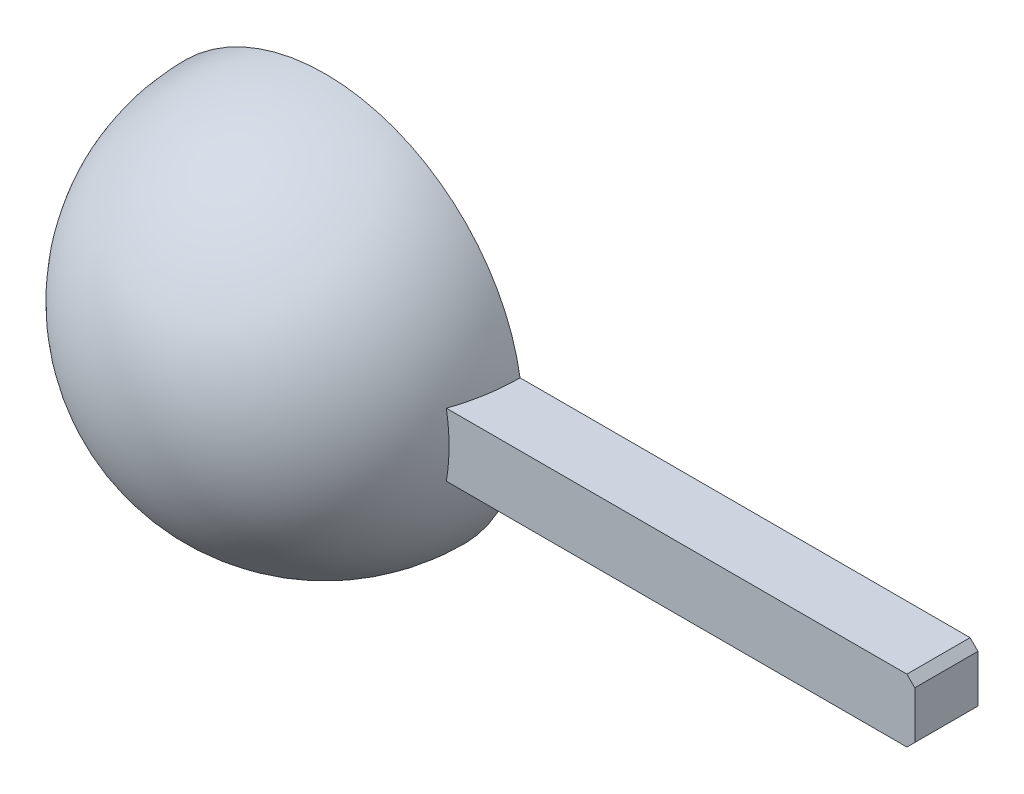
ISO-10303-21;
HEADER;
FILE_DESCRIPTION(('STEP AP214'),'2;1');
FILE_NAME('part.step','',(''),(''),'','','');
FILE_SCHEMA(('AUTOMOTIVE_DESIGN { 1 0 10303 214 1 1 1 1 }'));
ENDSEC;
DATA;
#1=APPLICATION_CONTEXT('core data for automotive mechanical design processes');
#2=APPLICATION_PROTOCOL_DEFINITION('international standard','automotive_design',2000,#1);
#3=PRODUCT_CONTEXT('',#1,'mechanical');
#4=PRODUCT('Part','Part','',(#3));
#5=PRODUCT_RELATED_PRODUCT_CATEGORY('part','',(#4));
#6=PRODUCT_DEFINITION_FORMATION('','',#4);
#7=PRODUCT_DEFINITION_CONTEXT('part definition',#1,'design');
#8=PRODUCT_DEFINITION('design','',#6,#7);
#9=PRODUCT_DEFINITION_SHAPE('','',#8);
#10=(LENGTH_UNIT() NAMED_UNIT(*) SI_UNIT(.MILLI.,.METRE.));
#11=(NAMED_UNIT(*) PLANE_ANGLE_UNIT() SI_UNIT($,.RADIAN.));
#12=(NAMED_UNIT(*) SI_UNIT($,.STERADIAN.) SOLID_ANGLE_UNIT());
#13=UNCERTAINTY_MEASURE_WITH_UNIT(LENGTH_MEASURE(1.E-05),#10,'distance_accuracy_value','');
#14=(GEOMETRIC_REPRESENTATION_CONTEXT(3) GLOBAL_UNCERTAINTY_ASSIGNED_CONTEXT((#13)) GLOBAL_UNIT_ASSIGNED_CONTEXT((#10,
#11,#12)) REPRESENTATION_CONTEXT('',''));
#15=CARTESIAN_POINT('',(0.,0.,0.));
#16=DIRECTION('',(0.,0.,1.));
#17=DIRECTION('',(1.,0.,0.));
#18=AXIS2_PLACEMENT_3D('',#15,#16,#17);
#19=CARTESIAN_POINT('',(0.,0.,0.));
#20=DIRECTION('',(-1.,0.,0.));
#21=DIRECTION('',(0.,-1.,0.));
#22=AXIS2_PLACEMENT_3D('',#19,#20,#21);
#23=SPHERICAL_SURFACE('',#22,25.);
#24=CARTESIAN_POINT('',(0.,0.,8.));
#25=DIRECTION('',(0.,0.,-1.));
#26=DIRECTION('',(-1.,0.,0.));
#27=AXIS2_PLACEMENT_3D('',#24,#25,#26);
#28=CIRCLE('',#27,23.685438564654);
#29=CARTESIAN_POINT('',(23.3452350598575,4.,8.));
#30=VERTEX_POINT('',#29);
#31=CARTESIAN_POINT('',(23.3452350598575,-4.,8.));
#32=VERTEX_POINT('',#31);
#33=EDGE_CURVE('E105',#30,#32,#28,.T.);
#34=ORIENTED_EDGE('',*,*,#33,.F.);
#35=CARTESIAN_POINT('',(0.,4.,0.));
#36=DIRECTION('',(0.,1.,0.));
#37=DIRECTION('',(0.,0.,1.));
#38=AXIS2_PLACEMENT_3D('',#35,#36,#37);
#39=CIRCLE('',#38,24.6779253585061);
#40=CARTESIAN_POINT('',(24.6779253585061,4.,0.));
#41=VERTEX_POINT('',#40);
#42=EDGE_CURVE('E100',#30,#41,#39,.T.);
#43=ORIENTED_EDGE('',*,*,#42,.T.);
#44=CARTESIAN_POINT('',(0.,0.,0.));
#45=DIRECTION('',(0.,0.,-1.));
#46=DIRECTION('',(-1.,0.,0.));
#47=AXIS2_PLACEMENT_3D('',#44,#45,#46);
#48=CIRCLE('',#47,25.);
#49=CARTESIAN_POINT('',(24.6779253585061,-4.,0.));
#50=VERTEX_POINT('',#49);
#51=EDGE_CURVE('E99',#50,#41,#48,.T.);
#52=ORIENTED_EDGE('',*,*,#51,.F.);
#53=CARTESIAN_POINT('',(0.,-4.,0.));
#54=DIRECTION('',(0.,-1.,0.));
#55=DIRECTION('',(1.,0.,0.));
#56=AXIS2_PLACEMENT_3D('',#53,#54,#55);
#57=CIRCLE('',#56,24.6779253585061);
#58=EDGE_CURVE('E118',#50,#32,#57,.T.);
#59=ORIENTED_EDGE('',*,*,#58,.T.);
#60=EDGE_LOOP('',(#34,#43,#52,#59));
#61=FACE_BOUND('',#60,.T.);
#62=ADVANCED_FACE('F33',(#61),#23,.T.);
#63=CARTESIAN_POINT('',(0.,0.,0.));
#64=DIRECTION('',(0.,0.,1.));
#65=DIRECTION('',(-1.,0.,0.));
#66=AXIS2_PLACEMENT_3D('',#63,#64,#65);
#67=PLANE('',#66);
#68=DIRECTION('',(0.,1.,0.));
#69=VECTOR('',#68,1.);
#70=CARTESIAN_POINT('',(22.6495033058122,-4.,0.));
#71=LINE('',#70,#69);
#72=CARTESIAN_POINT('',(22.6495033058122,-4.,0.));
#73=VERTEX_POINT('',#72);
#74=CARTESIAN_POINT('',(22.6495033058122,4.,0.));
#75=VERTEX_POINT('',#74);
#76=EDGE_CURVE('E96',#73,#75,#71,.T.);
#77=ORIENTED_EDGE('',*,*,#76,.T.);
#78=CARTESIAN_POINT('',(0.,0.,0.));
#79=DIRECTION('',(0.,0.,1.));
#80=DIRECTION('',(0.,-1.,0.));
#81=AXIS2_PLACEMENT_3D('',#78,#79,#80);
#82=CIRCLE('',#81,23.);
#83=EDGE_CURVE('E91',#73,#75,#82,.F.);
#84=ORIENTED_EDGE('',*,*,#83,.F.);
#85=EDGE_LOOP('',(#77,#84));
#86=FACE_BOUND('',#85,.T.);
#87=DIRECTION('',(1.,0.,0.));
#88=VECTOR('',#87,1.);
#89=CARTESIAN_POINT('',(22.6495033058122,4.,0.));
#90=LINE('',#89,#88);
#91=CARTESIAN_POINT('',(81.6495033058122,4.,0.));
#92=VERTEX_POINT('',#91);
#93=EDGE_CURVE('E108',#41,#92,#90,.T.);
#94=ORIENTED_EDGE('',*,*,#93,.T.);
#95=DIRECTION('',(-0.707106781186552,0.707106781186543,0.));
#96=VECTOR('',#95,1.);
#97=CARTESIAN_POINT('',(81.6495033058122,4.00000000000003,0.));
#98=LINE('',#97,#96);
#99=CARTESIAN_POINT('',(82.6495033058122,3.,0.));
#100=VERTEX_POINT('',#99);
#101=EDGE_CURVE('E133',#92,#100,#98,.F.);
#102=ORIENTED_EDGE('',*,*,#101,.T.);
#103=DIRECTION('',(0.,-1.,0.));
#104=VECTOR('',#103,1.);
#105=CARTESIAN_POINT('',(82.6495033058122,4.,0.));
#106=LINE('',#105,#104);
#107=CARTESIAN_POINT('',(82.6495033058122,-3.,0.));
#108=VERTEX_POINT('',#107);
#109=EDGE_CURVE('E114',#100,#108,#106,.T.);
#110=ORIENTED_EDGE('',*,*,#109,.T.);
#111=DIRECTION('',(0.707106781186552,0.707106781186543,0.));
#112=VECTOR('',#111,1.);
#113=CARTESIAN_POINT('',(82.6495033058123,-2.99999999999998,0.));
#114=LINE('',#113,#112);
#115=CARTESIAN_POINT('',(81.6495033058122,-3.99999999999999,0.));
#116=VERTEX_POINT('',#115);
#117=EDGE_CURVE('E131',#108,#116,#114,.F.);
#118=ORIENTED_EDGE('',*,*,#117,.T.);
#119=DIRECTION('',(-1.,0.,0.));
#120=VECTOR('',#119,1.);
#121=CARTESIAN_POINT('',(82.6495033058122,-3.99999999999999,0.));
#122=LINE('',#121,#120);
#123=EDGE_CURVE('E109',#116,#50,#122,.T.);
#124=ORIENTED_EDGE('',*,*,#123,.T.);
#125=ORIENTED_EDGE('',*,*,#51,.T.);
#126=EDGE_LOOP('',(#94,#102,#110,#118,#124,#125));
#127=FACE_BOUND('',#126,.T.);
#128=ADVANCED_FACE('F93',(#86,#127),#67,.F.);
#129=CARTESIAN_POINT('',(0.,0.,0.));
#130=DIRECTION('',(-1.,0.,0.));
#131=DIRECTION('',(0.,-1.,0.));
#132=AXIS2_PLACEMENT_3D('',#129,#130,#131);
#133=SPHERICAL_SURFACE('',#132,23.);
#134=CARTESIAN_POINT('',(22.6495033058122,0.,0.));
#135=DIRECTION('',(-1.,0.,0.));
#136=DIRECTION('',(0.,0.,1.));
#137=AXIS2_PLACEMENT_3D('',#134,#135,#136);
#138=CIRCLE('',#137,3.99999999999999);
#139=EDGE_CURVE('E102',#73,#75,#138,.T.);
#140=ORIENTED_EDGE('',*,*,#139,.F.);
#141=ORIENTED_EDGE('',*,*,#83,.T.);
#142=EDGE_LOOP('',(#140,#141));
#143=FACE_BOUND('',#142,.T.);
#144=ADVANCED_FACE('F103',(#143),#133,.F.);
#145=CARTESIAN_POINT('',(22.6495033058122,-4.,8.));
#146=DIRECTION('',(-1.,0.,0.));
#147=DIRECTION('',(0.,0.,1.));
#148=AXIS2_PLACEMENT_3D('',#145,#146,#147);
#149=PLANE('',#148);
#150=ORIENTED_EDGE('',*,*,#76,.F.);
#151=ORIENTED_EDGE('',*,*,#139,.T.);
#152=EDGE_LOOP('',(#150,#151));
#153=FACE_BOUND('',#152,.T.);
#154=ADVANCED_FACE('F107',(#153),#149,.T.);
#155=CARTESIAN_POINT('',(82.6495033058122,4.,8.));
#156=DIRECTION('',(1.,0.,0.));
#157=DIRECTION('',(0.,0.,-1.));
#158=AXIS2_PLACEMENT_3D('',#155,#156,#157);
#159=PLANE('',#158);
#160=ORIENTED_EDGE('',*,*,#109,.F.);
#161=DIRECTION('',(0.,0.,1.));
#162=VECTOR('',#161,1.);
#163=CARTESIAN_POINT('',(82.6495033058122,3.,8.));
#164=LINE('',#163,#162);
#165=CARTESIAN_POINT('',(82.6495033058122,3.,8.));
#166=VERTEX_POINT('',#165);
#167=EDGE_CURVE('E138',#100,#166,#164,.T.);
#168=ORIENTED_EDGE('',*,*,#167,.T.);
#169=DIRECTION('',(0.,-1.,0.));
#170=VECTOR('',#169,1.);
#171=CARTESIAN_POINT('',(82.6495033058122,4.,8.));
#172=LINE('',#171,#170);
#173=CARTESIAN_POINT('',(82.6495033058122,-3.,8.));
#174=VERTEX_POINT('',#173);
#175=EDGE_CURVE('E112',#166,#174,#172,.T.);
#176=ORIENTED_EDGE('',*,*,#175,.T.);
#177=DIRECTION('',(0.,0.,-1.));
#178=VECTOR('',#177,1.);
#179=CARTESIAN_POINT('',(82.6495033058122,-3.,8.));
#180=LINE('',#179,#178);
#181=EDGE_CURVE('E135',#174,#108,#180,.T.);
#182=ORIENTED_EDGE('',*,*,#181,.T.);
#183=EDGE_LOOP('',(#160,#168,#176,#182));
#184=FACE_BOUND('',#183,.T.);
#185=ADVANCED_FACE('F156',(#184),#159,.T.);
#186=CARTESIAN_POINT('',(22.6495033058122,4.,8.));
#187=DIRECTION('',(0.,1.,0.));
#188=DIRECTION('',(0.,0.,1.));
#189=AXIS2_PLACEMENT_3D('',#186,#187,#188);
#190=PLANE('',#189);
#191=DIRECTION('',(1.,0.,0.));
#192=VECTOR('',#191,1.);
#193=CARTESIAN_POINT('',(22.6495033058122,4.,8.));
#194=LINE('',#193,#192);
#195=CARTESIAN_POINT('',(81.6495033058122,4.,8.));
#196=VERTEX_POINT('',#195);
#197=EDGE_CURVE('E121',#30,#196,#194,.T.);
#198=ORIENTED_EDGE('',*,*,#197,.T.);
#199=DIRECTION('',(0.,0.,-1.));
#200=VECTOR('',#199,1.);
#201=CARTESIAN_POINT('',(81.6495033058122,4.,8.));
#202=LINE('',#201,#200);
#203=EDGE_CURVE('E128',#196,#92,#202,.T.);
#204=ORIENTED_EDGE('',*,*,#203,.T.);
#205=ORIENTED_EDGE('',*,*,#93,.F.);
#206=ORIENTED_EDGE('',*,*,#42,.F.);
#207=EDGE_LOOP('',(#198,#204,#205,#206));
#208=FACE_BOUND('',#207,.T.);
#209=ADVANCED_FACE('F149',(#208),#190,.T.);
#210=CARTESIAN_POINT('',(82.6495033058122,-3.99999999999999,8.));
#211=DIRECTION('',(0.,-1.,0.));
#212=DIRECTION('',(1.,0.,0.));
#213=AXIS2_PLACEMENT_3D('',#210,#211,#212);
#214=PLANE('',#213);
#215=ORIENTED_EDGE('',*,*,#123,.F.);
#216=DIRECTION('',(0.,0.,1.));
#217=VECTOR('',#216,1.);
#218=CARTESIAN_POINT('',(81.6495033058122,-3.99999999999999,8.));
#219=LINE('',#218,#217);
#220=CARTESIAN_POINT('',(81.6495033058122,-3.99999999999999,8.));
#221=VERTEX_POINT('',#220);
#222=EDGE_CURVE('E11',#116,#221,#219,.T.);
#223=ORIENTED_EDGE('',*,*,#222,.T.);
#224=DIRECTION('',(-1.,0.,0.));
#225=VECTOR('',#224,1.);
#226=CARTESIAN_POINT('',(82.6495033058122,-3.99999999999999,8.));
#227=LINE('',#226,#225);
#228=EDGE_CURVE('E150',#221,#32,#227,.T.);
#229=ORIENTED_EDGE('',*,*,#228,.T.);
#230=ORIENTED_EDGE('',*,*,#58,.F.);
#231=EDGE_LOOP('',(#215,#223,#229,#230));
#232=FACE_BOUND('',#231,.T.);
#233=ADVANCED_FACE('F162',(#232),#214,.T.);
#234=CARTESIAN_POINT('',(0.,0.,8.));
#235=DIRECTION('',(0.,0.,-1.));
#236=DIRECTION('',(-1.,0.,0.));
#237=AXIS2_PLACEMENT_3D('',#234,#235,#236);
#238=PLANE('',#237);
#239=ORIENTED_EDGE('',*,*,#175,.F.);
#240=DIRECTION('',(0.707106781186552,-0.707106781186543,0.));
#241=VECTOR('',#240,1.);
#242=CARTESIAN_POINT('',(81.6495033058122,4.,8.));
#243=LINE('',#242,#241);
#244=EDGE_CURVE('E41',#166,#196,#243,.F.);
#245=ORIENTED_EDGE('',*,*,#244,.T.);
#246=ORIENTED_EDGE('',*,*,#197,.F.);
#247=ORIENTED_EDGE('',*,*,#33,.T.);
#248=ORIENTED_EDGE('',*,*,#228,.F.);
#249=DIRECTION('',(-0.707106781186552,-0.707106781186543,0.));
#250=VECTOR('',#249,1.);
#251=CARTESIAN_POINT('',(82.6495033058122,-3.,8.));
#252=LINE('',#251,#250);
#253=EDGE_CURVE('E53',#221,#174,#252,.F.);
#254=ORIENTED_EDGE('',*,*,#253,.T.);
#255=EDGE_LOOP('',(#239,#245,#246,#247,#248,#254));
#256=FACE_BOUND('',#255,.T.);
#257=ADVANCED_FACE('F143',(#256),#238,.F.);
#258=CARTESIAN_POINT('',(81.6495033058122,4.,8.));
#259=DIRECTION('',(-0.707106781186542,-0.707106781186552,0.));
#260=DIRECTION('',(0.,0.,-1.));
#261=AXIS2_PLACEMENT_3D('',#258,#259,#260);
#262=PLANE('',#261);
#263=ORIENTED_EDGE('',*,*,#244,.F.);
#264=ORIENTED_EDGE('',*,*,#167,.F.);
#265=ORIENTED_EDGE('',*,*,#101,.F.);
#266=ORIENTED_EDGE('',*,*,#203,.F.);
#267=EDGE_LOOP('',(#263,#264,#265,#266));
#268=FACE_BOUND('',#267,.T.);
#269=ADVANCED_FACE('F152',(#268),#262,.F.);
#270=CARTESIAN_POINT('',(82.6495033058122,-3.,8.));
#271=DIRECTION('',(-0.707106781186543,0.707106781186552,0.));
#272=DIRECTION('',(0.,0.,-1.));
#273=AXIS2_PLACEMENT_3D('',#270,#271,#272);
#274=PLANE('',#273);
#275=ORIENTED_EDGE('',*,*,#253,.F.);
#276=ORIENTED_EDGE('',*,*,#222,.F.);
#277=ORIENTED_EDGE('',*,*,#117,.F.);
#278=ORIENTED_EDGE('',*,*,#181,.F.);
#279=EDGE_LOOP('',(#275,#276,#277,#278));
#280=FACE_BOUND('',#279,.T.);
#281=ADVANCED_FACE('F35',(#280),#274,.F.);
#282=CLOSED_SHELL('',(#62,#128,#144,#154,#185,#209,#233,#257,#269,#281));
#283=MANIFOLD_SOLID_BREP('B2',#282);
#284=ADVANCED_BREP_SHAPE_REPRESENTATION('',(#18,#283),#14);
#285=SHAPE_DEFINITION_REPRESENTATION(#9,#284);
ENDSEC;
END-ISO-10303-21;
